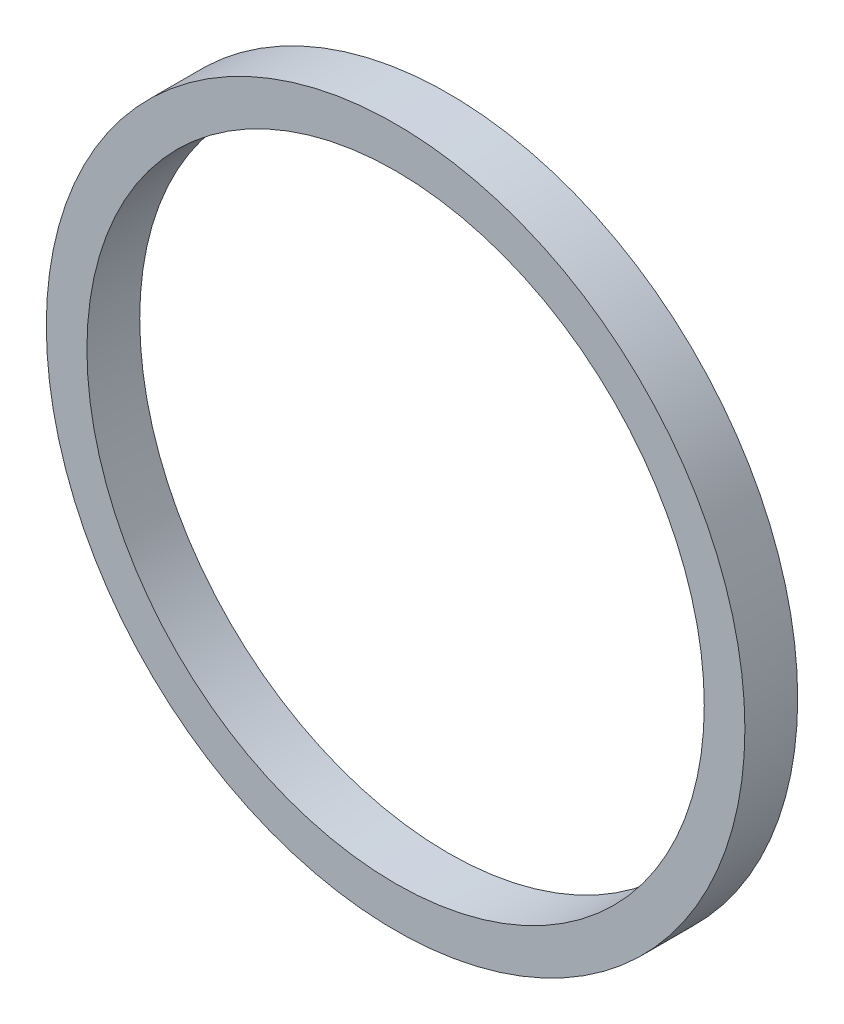
ISO-10303-21;
HEADER;
FILE_DESCRIPTION(('STEP AP214'),'2;1');
FILE_NAME('part.step','',(''),(''),'','','');
FILE_SCHEMA(('AUTOMOTIVE_DESIGN { 1 0 10303 214 1 1 1 1 }'));
ENDSEC;
DATA;
#1=APPLICATION_CONTEXT('core data for automotive mechanical design processes');
#2=APPLICATION_PROTOCOL_DEFINITION('international standard','automotive_design',2000,#1);
#3=PRODUCT_CONTEXT('',#1,'mechanical');
#4=PRODUCT('Part','Part','',(#3));
#5=PRODUCT_RELATED_PRODUCT_CATEGORY('part','',(#4));
#6=PRODUCT_DEFINITION_FORMATION('','',#4);
#7=PRODUCT_DEFINITION_CONTEXT('part definition',#1,'design');
#8=PRODUCT_DEFINITION('design','',#6,#7);
#9=PRODUCT_DEFINITION_SHAPE('','',#8);
#10=(LENGTH_UNIT() NAMED_UNIT(*) SI_UNIT(.MILLI.,.METRE.));
#11=(NAMED_UNIT(*) PLANE_ANGLE_UNIT() SI_UNIT($,.RADIAN.));
#12=(NAMED_UNIT(*) SI_UNIT($,.STERADIAN.) SOLID_ANGLE_UNIT());
#13=UNCERTAINTY_MEASURE_WITH_UNIT(LENGTH_MEASURE(1.E-05),#10,'distance_accuracy_value','');
#14=(GEOMETRIC_REPRESENTATION_CONTEXT(3) GLOBAL_UNCERTAINTY_ASSIGNED_CONTEXT((#13)) GLOBAL_UNIT_ASSIGNED_CONTEXT((#10,
#11,#12)) REPRESENTATION_CONTEXT('',''));
#15=CARTESIAN_POINT('',(0.,0.,0.));
#16=DIRECTION('',(0.,0.,1.));
#17=DIRECTION('',(1.,0.,0.));
#18=AXIS2_PLACEMENT_3D('',#15,#16,#17);
#19=CARTESIAN_POINT('',(0.,0.,13.));
#20=DIRECTION('',(0.,0.,1.));
#21=DIRECTION('',(1.,0.,0.));
#22=AXIS2_PLACEMENT_3D('',#19,#20,#21);
#23=PLANE('',#22);
#24=CARTESIAN_POINT('',(0.,0.,13.));
#25=DIRECTION('',(0.,0.,1.));
#26=DIRECTION('',(1.,0.,0.));
#27=AXIS2_PLACEMENT_3D('',#24,#25,#26);
#28=CIRCLE('',#27,86.);
#29=CARTESIAN_POINT('',(86.,0.,13.));
#30=VERTEX_POINT('',#29);
#31=EDGE_CURVE('E10',#30,#30,#28,.T.);
#32=ORIENTED_EDGE('',*,*,#31,.T.);
#33=EDGE_LOOP('',(#32));
#34=FACE_BOUND('',#33,.T.);
#35=CARTESIAN_POINT('',(0.,0.,13.));
#36=DIRECTION('',(0.,0.,1.));
#37=DIRECTION('',(1.,0.,0.));
#38=AXIS2_PLACEMENT_3D('',#35,#36,#37);
#39=CIRCLE('',#38,76.);
#40=CARTESIAN_POINT('',(76.,0.,13.));
#41=VERTEX_POINT('',#40);
#42=EDGE_CURVE('E44',#41,#41,#39,.T.);
#43=ORIENTED_EDGE('',*,*,#42,.F.);
#44=EDGE_LOOP('',(#43));
#45=FACE_BOUND('',#44,.T.);
#46=ADVANCED_FACE('F33',(#34,#45),#23,.T.);
#47=CARTESIAN_POINT('',(0.,0.,0.));
#48=DIRECTION('',(0.,0.,1.));
#49=DIRECTION('',(1.,0.,0.));
#50=AXIS2_PLACEMENT_3D('',#47,#48,#49);
#51=PLANE('',#50);
#52=CARTESIAN_POINT('',(0.,0.,0.));
#53=DIRECTION('',(0.,0.,1.));
#54=DIRECTION('',(1.,0.,0.));
#55=AXIS2_PLACEMENT_3D('',#52,#53,#54);
#56=CIRCLE('',#55,86.);
#57=CARTESIAN_POINT('',(86.,0.,0.));
#58=VERTEX_POINT('',#57);
#59=EDGE_CURVE('E37',#58,#58,#56,.T.);
#60=ORIENTED_EDGE('',*,*,#59,.F.);
#61=EDGE_LOOP('',(#60));
#62=FACE_BOUND('',#61,.T.);
#63=CARTESIAN_POINT('',(0.,0.,0.));
#64=DIRECTION('',(0.,0.,1.));
#65=DIRECTION('',(1.,0.,0.));
#66=AXIS2_PLACEMENT_3D('',#63,#64,#65);
#67=CIRCLE('',#66,76.);
#68=CARTESIAN_POINT('',(76.,0.,0.));
#69=VERTEX_POINT('',#68);
#70=EDGE_CURVE('E46',#69,#69,#67,.T.);
#71=ORIENTED_EDGE('',*,*,#70,.T.);
#72=EDGE_LOOP('',(#71));
#73=FACE_BOUND('',#72,.T.);
#74=ADVANCED_FACE('F56',(#62,#73),#51,.F.);
#75=CARTESIAN_POINT('',(0.,0.,13.));
#76=DIRECTION('',(0.,0.,-1.));
#77=DIRECTION('',(-1.,0.,0.));
#78=AXIS2_PLACEMENT_3D('',#75,#76,#77);
#79=CYLINDRICAL_SURFACE('',#78,86.);
#80=ORIENTED_EDGE('',*,*,#31,.F.);
#81=EDGE_LOOP('',(#80));
#82=FACE_BOUND('',#81,.T.);
#83=ORIENTED_EDGE('',*,*,#59,.T.);
#84=EDGE_LOOP('',(#83));
#85=FACE_BOUND('',#84,.T.);
#86=ADVANCED_FACE('F35',(#82,#85),#79,.T.);
#87=CARTESIAN_POINT('',(0.,0.,13.));
#88=DIRECTION('',(0.,0.,-1.));
#89=DIRECTION('',(-1.,0.,0.));
#90=AXIS2_PLACEMENT_3D('',#87,#88,#89);
#91=CYLINDRICAL_SURFACE('',#90,76.);
#92=ORIENTED_EDGE('',*,*,#42,.T.);
#93=EDGE_LOOP('',(#92));
#94=FACE_BOUND('',#93,.T.);
#95=ORIENTED_EDGE('',*,*,#70,.F.);
#96=EDGE_LOOP('',(#95));
#97=FACE_BOUND('',#96,.T.);
#98=ADVANCED_FACE('F52',(#94,#97),#91,.F.);
#99=CLOSED_SHELL('',(#46,#74,#86,#98));
#100=MANIFOLD_SOLID_BREP('B2',#99);
#101=ADVANCED_BREP_SHAPE_REPRESENTATION('',(#18,#100),#14);
#102=SHAPE_DEFINITION_REPRESENTATION(#9,#101);
ENDSEC;
END-ISO-10303-21;
